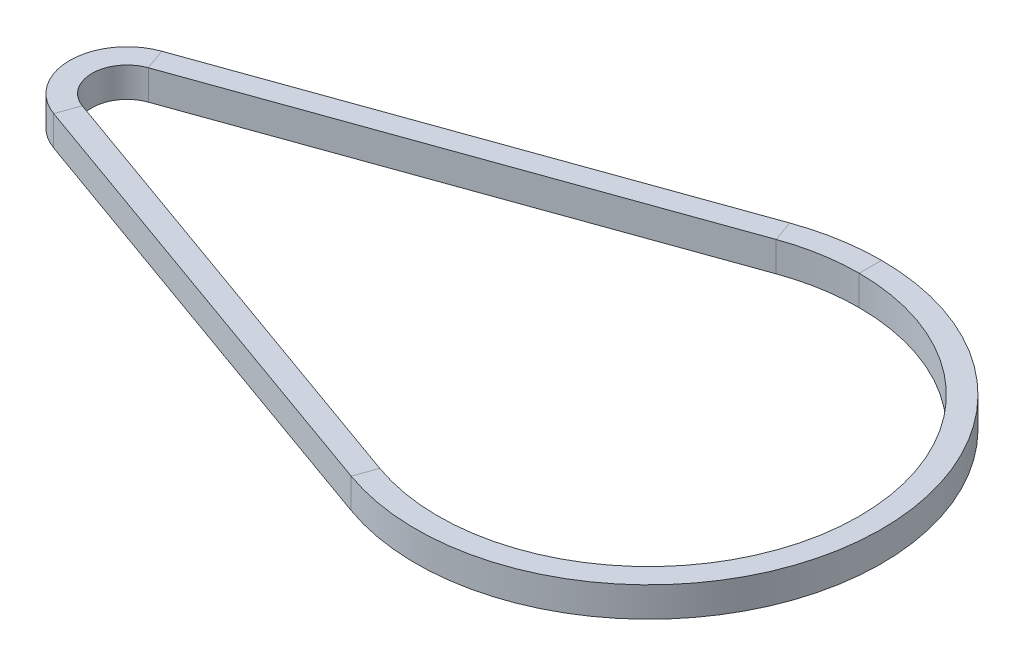
ISO-10303-21;
HEADER;
FILE_DESCRIPTION(('STEP AP214'),'2;1');
FILE_NAME('part.step','',(''),(''),'','','');
FILE_SCHEMA(('AUTOMOTIVE_DESIGN { 1 0 10303 214 1 1 1 1 }'));
ENDSEC;
DATA;
#1=APPLICATION_CONTEXT('core data for automotive mechanical design processes');
#2=APPLICATION_PROTOCOL_DEFINITION('international standard','automotive_design',2000,#1);
#3=PRODUCT_CONTEXT('',#1,'mechanical');
#4=PRODUCT('Part','Part','',(#3));
#5=PRODUCT_RELATED_PRODUCT_CATEGORY('part','',(#4));
#6=PRODUCT_DEFINITION_FORMATION('','',#4);
#7=PRODUCT_DEFINITION_CONTEXT('part definition',#1,'design');
#8=PRODUCT_DEFINITION('design','',#6,#7);
#9=PRODUCT_DEFINITION_SHAPE('','',#8);
#10=(LENGTH_UNIT() NAMED_UNIT(*) SI_UNIT(.MILLI.,.METRE.));
#11=(NAMED_UNIT(*) PLANE_ANGLE_UNIT() SI_UNIT($,.RADIAN.));
#12=(NAMED_UNIT(*) SI_UNIT($,.STERADIAN.) SOLID_ANGLE_UNIT());
#13=UNCERTAINTY_MEASURE_WITH_UNIT(LENGTH_MEASURE(1.E-05),#10,'distance_accuracy_value','');
#14=(GEOMETRIC_REPRESENTATION_CONTEXT(3) GLOBAL_UNCERTAINTY_ASSIGNED_CONTEXT((#13)) GLOBAL_UNIT_ASSIGNED_CONTEXT((#10,
#11,#12)) REPRESENTATION_CONTEXT('',''));
#15=CARTESIAN_POINT('',(0.,0.,0.));
#16=DIRECTION('',(0.,0.,1.));
#17=DIRECTION('',(1.,0.,0.));
#18=AXIS2_PLACEMENT_3D('',#15,#16,#17);
#19=CARTESIAN_POINT('',(59.4944342857143,-2.,-29.4205827444465));
#20=DIRECTION('',(0.,-1.,0.));
#21=DIRECTION('',(0.,0.,-1.));
#22=AXIS2_PLACEMENT_3D('',#19,#20,#21);
#23=PLANE('',#22);
#24=CARTESIAN_POINT('',(70.,-2.,0.));
#25=DIRECTION('',(0.,-1.,0.));
#26=DIRECTION('',(-0.336285714285714,0.,-0.941760011025817));
#27=AXIS2_PLACEMENT_3D('',#24,#25,#26);
#28=CIRCLE('',#27,28.24);
#29=CARTESIAN_POINT('',(60.5032914285715,-2.,-26.5953027113691));
#30=VERTEX_POINT('',#29);
#31=CARTESIAN_POINT('',(70.,-2.,-28.24));
#32=VERTEX_POINT('',#31);
#33=EDGE_CURVE('E11',#30,#32,#28,.T.);
#34=ORIENTED_EDGE('',*,*,#33,.F.);
#35=DIRECTION('',(-0.336285714285714,0.,-0.941760011025817));
#36=VECTOR('',#35,1.);
#37=CARTESIAN_POINT('',(59.4944342857143,-2.,-29.4205827444465));
#38=LINE('',#37,#36);
#39=CARTESIAN_POINT('',(59.4944342857143,-2.,-29.4205827444465));
#40=VERTEX_POINT('',#39);
#41=EDGE_CURVE('E36',#30,#40,#38,.T.);
#42=ORIENTED_EDGE('',*,*,#41,.T.);
#43=CARTESIAN_POINT('',(70.,-2.,0.));
#44=DIRECTION('',(0.,-1.,0.));
#45=DIRECTION('',(-0.336285714285714,0.,-0.941760011025817));
#46=AXIS2_PLACEMENT_3D('',#43,#44,#45);
#47=CIRCLE('',#46,31.24);
#48=CARTESIAN_POINT('',(70.,-2.,-31.24));
#49=VERTEX_POINT('',#48);
#50=EDGE_CURVE('E133',#40,#49,#47,.T.);
#51=ORIENTED_EDGE('',*,*,#50,.T.);
#52=DIRECTION('',(0.,0.,-1.));
#53=VECTOR('',#52,1.);
#54=CARTESIAN_POINT('',(70.,-2.,-31.24));
#55=LINE('',#54,#53);
#56=EDGE_CURVE('E136',#32,#49,#55,.T.);
#57=ORIENTED_EDGE('',*,*,#56,.F.);
#58=EDGE_LOOP('',(#34,#42,#51,#57));
#59=FACE_BOUND('',#58,.T.);
#60=ADVANCED_FACE('F33',(#59),#23,.T.);
#61=CARTESIAN_POINT('',(70.,0.,0.));
#62=DIRECTION('',(0.,-1.,0.));
#63=DIRECTION('',(0.,0.,-1.));
#64=AXIS2_PLACEMENT_3D('',#61,#62,#63);
#65=CYLINDRICAL_SURFACE('',#64,28.24);
#66=CARTESIAN_POINT('',(70.,2.,0.));
#67=DIRECTION('',(0.,-1.,0.));
#68=DIRECTION('',(-0.336285714285714,0.,-0.941760011025817));
#69=AXIS2_PLACEMENT_3D('',#66,#67,#68);
#70=CIRCLE('',#69,28.24);
#71=CARTESIAN_POINT('',(60.5032914285715,2.,-26.5953027113691));
#72=VERTEX_POINT('',#71);
#73=CARTESIAN_POINT('',(70.,2.,-28.24));
#74=VERTEX_POINT('',#73);
#75=EDGE_CURVE('E41',#72,#74,#70,.T.);
#76=ORIENTED_EDGE('',*,*,#75,.F.);
#77=DIRECTION('',(0.,-1.,0.));
#78=VECTOR('',#77,1.);
#79=CARTESIAN_POINT('',(60.5032914285715,-2.,-26.5953027113691));
#80=LINE('',#79,#78);
#81=EDGE_CURVE('E219',#72,#30,#80,.T.);
#82=ORIENTED_EDGE('',*,*,#81,.T.);
#83=ORIENTED_EDGE('',*,*,#33,.T.);
#84=DIRECTION('',(0.,-1.,0.));
#85=VECTOR('',#84,1.);
#86=CARTESIAN_POINT('',(70.,-2.,-28.24));
#87=LINE('',#86,#85);
#88=EDGE_CURVE('E160',#74,#32,#87,.T.);
#89=ORIENTED_EDGE('',*,*,#88,.F.);
#90=EDGE_LOOP('',(#76,#82,#83,#89));
#91=FACE_BOUND('',#90,.T.);
#92=ADVANCED_FACE('F265',(#91),#65,.F.);
#93=CARTESIAN_POINT('',(59.4944342857143,2.,-29.4205827444465));
#94=DIRECTION('',(0.,1.,0.));
#95=DIRECTION('',(0.,0.,1.));
#96=AXIS2_PLACEMENT_3D('',#93,#94,#95);
#97=PLANE('',#96);
#98=CARTESIAN_POINT('',(70.,2.,0.));
#99=DIRECTION('',(0.,-1.,0.));
#100=DIRECTION('',(-0.336285714285714,0.,-0.941760011025817));
#101=AXIS2_PLACEMENT_3D('',#98,#99,#100);
#102=CIRCLE('',#101,31.24);
#103=CARTESIAN_POINT('',(59.4944342857143,2.,-29.4205827444465));
#104=VERTEX_POINT('',#103);
#105=CARTESIAN_POINT('',(70.,2.,-31.24));
#106=VERTEX_POINT('',#105);
#107=EDGE_CURVE('E142',#104,#106,#102,.T.);
#108=ORIENTED_EDGE('',*,*,#107,.F.);
#109=DIRECTION('',(0.336285714285714,0.,0.941760011025817));
#110=VECTOR('',#109,1.);
#111=CARTESIAN_POINT('',(59.4944342857143,2.,-29.4205827444465));
#112=LINE('',#111,#110);
#113=EDGE_CURVE('E197',#104,#72,#112,.T.);
#114=ORIENTED_EDGE('',*,*,#113,.T.);
#115=ORIENTED_EDGE('',*,*,#75,.T.);
#116=DIRECTION('',(0.,0.,1.));
#117=VECTOR('',#116,1.);
#118=CARTESIAN_POINT('',(70.,2.,-31.24));
#119=LINE('',#118,#117);
#120=EDGE_CURVE('E164',#106,#74,#119,.T.);
#121=ORIENTED_EDGE('',*,*,#120,.F.);
#122=EDGE_LOOP('',(#108,#114,#115,#121));
#123=FACE_BOUND('',#122,.T.);
#124=ADVANCED_FACE('F269',(#123),#97,.T.);
#125=CARTESIAN_POINT('',(-2.5894,-2.,-7.25155208489878));
#126=DIRECTION('',(0.,-1.,0.));
#127=DIRECTION('',(0.,0.,-1.));
#128=AXIS2_PLACEMENT_3D('',#125,#126,#127);
#129=PLANE('',#128);
#130=ORIENTED_EDGE('',*,*,#41,.F.);
#131=DIRECTION('',(0.941760011025817,0.,-0.336285714285714));
#132=VECTOR('',#131,1.);
#133=CARTESIAN_POINT('',(-1.58054285714286,-2.,-4.42627205182133));
#134=LINE('',#133,#132);
#135=CARTESIAN_POINT('',(-1.58054285714285,-2.,-4.42627205182134));
#136=VERTEX_POINT('',#135);
#137=EDGE_CURVE('E82',#136,#30,#134,.T.);
#138=ORIENTED_EDGE('',*,*,#137,.F.);
#139=DIRECTION('',(-0.336285714285714,0.,-0.941760011025817));
#140=VECTOR('',#139,1.);
#141=CARTESIAN_POINT('',(-2.58939999999999,-2.,-7.25155208489878));
#142=LINE('',#141,#140);
#143=CARTESIAN_POINT('',(-2.58939999999999,-2.,-7.25155208489879));
#144=VERTEX_POINT('',#143);
#145=EDGE_CURVE('E200',#136,#144,#142,.T.);
#146=ORIENTED_EDGE('',*,*,#145,.T.);
#147=DIRECTION('',(0.941760011025817,0.,-0.336285714285714));
#148=VECTOR('',#147,1.);
#149=CARTESIAN_POINT('',(-2.5894,-2.,-7.25155208489878));
#150=LINE('',#149,#148);
#151=EDGE_CURVE('E195',#144,#40,#150,.T.);
#152=ORIENTED_EDGE('',*,*,#151,.T.);
#153=EDGE_LOOP('',(#130,#138,#146,#152));
#154=FACE_BOUND('',#153,.T.);
#155=ADVANCED_FACE('F238',(#154),#129,.T.);
#156=CARTESIAN_POINT('',(-1.58054285714286,-2.,-4.42627205182133));
#157=DIRECTION('',(0.336285714285714,0.,0.941760011025817));
#158=DIRECTION('',(0.941760011025817,0.,-0.336285714285714));
#159=AXIS2_PLACEMENT_3D('',#156,#157,#158);
#160=PLANE('',#159);
#161=ORIENTED_EDGE('',*,*,#137,.T.);
#162=ORIENTED_EDGE('',*,*,#81,.F.);
#163=DIRECTION('',(0.941760011025817,0.,-0.336285714285714));
#164=VECTOR('',#163,1.);
#165=CARTESIAN_POINT('',(-1.58054285714286,2.,-4.42627205182133));
#166=LINE('',#165,#164);
#167=CARTESIAN_POINT('',(-1.58054285714285,2.,-4.42627205182134));
#168=VERTEX_POINT('',#167);
#169=EDGE_CURVE('E91',#168,#72,#166,.T.);
#170=ORIENTED_EDGE('',*,*,#169,.F.);
#171=DIRECTION('',(0.,-1.,0.));
#172=VECTOR('',#171,1.);
#173=CARTESIAN_POINT('',(-1.58054285714285,-2.,-4.42627205182133));
#174=LINE('',#173,#172);
#175=EDGE_CURVE('E215',#168,#136,#174,.T.);
#176=ORIENTED_EDGE('',*,*,#175,.T.);
#177=EDGE_LOOP('',(#161,#162,#170,#176));
#178=FACE_BOUND('',#177,.T.);
#179=ADVANCED_FACE('F266',(#178),#160,.T.);
#180=CARTESIAN_POINT('',(-2.5894,2.,-7.25155208489878));
#181=DIRECTION('',(0.,1.,0.));
#182=DIRECTION('',(0.,0.,1.));
#183=AXIS2_PLACEMENT_3D('',#180,#181,#182);
#184=PLANE('',#183);
#185=ORIENTED_EDGE('',*,*,#169,.T.);
#186=ORIENTED_EDGE('',*,*,#113,.F.);
#187=DIRECTION('',(0.941760011025817,0.,-0.336285714285714));
#188=VECTOR('',#187,1.);
#189=CARTESIAN_POINT('',(-2.5894,2.,-7.25155208489878));
#190=LINE('',#189,#188);
#191=CARTESIAN_POINT('',(-2.58939999999999,2.,-7.25155208489879));
#192=VERTEX_POINT('',#191);
#193=EDGE_CURVE('E99',#192,#104,#190,.T.);
#194=ORIENTED_EDGE('',*,*,#193,.F.);
#195=DIRECTION('',(0.336285714285714,0.,0.941760011025817));
#196=VECTOR('',#195,1.);
#197=CARTESIAN_POINT('',(-2.58939999999999,2.,-7.25155208489878));
#198=LINE('',#197,#196);
#199=EDGE_CURVE('E189',#192,#168,#198,.T.);
#200=ORIENTED_EDGE('',*,*,#199,.T.);
#201=EDGE_LOOP('',(#185,#186,#194,#200));
#202=FACE_BOUND('',#201,.T.);
#203=ADVANCED_FACE('F267',(#202),#184,.T.);
#204=CARTESIAN_POINT('',(-2.5894,-2.,-7.25155208489878));
#205=DIRECTION('',(-0.336285714285714,0.,-0.941760011025817));
#206=DIRECTION('',(-0.941760011025817,0.,0.336285714285714));
#207=AXIS2_PLACEMENT_3D('',#204,#205,#206);
#208=PLANE('',#207);
#209=ORIENTED_EDGE('',*,*,#193,.T.);
#210=DIRECTION('',(0.,1.,0.));
#211=VECTOR('',#210,1.);
#212=CARTESIAN_POINT('',(59.4944342857143,-2.,-29.4205827444465));
#213=LINE('',#212,#211);
#214=EDGE_CURVE('E193',#40,#104,#213,.T.);
#215=ORIENTED_EDGE('',*,*,#214,.F.);
#216=ORIENTED_EDGE('',*,*,#151,.F.);
#217=DIRECTION('',(0.,1.,0.));
#218=VECTOR('',#217,1.);
#219=CARTESIAN_POINT('',(-2.58939999999999,-2.,-7.25155208489878));
#220=LINE('',#219,#218);
#221=EDGE_CURVE('E182',#144,#192,#220,.T.);
#222=ORIENTED_EDGE('',*,*,#221,.T.);
#223=EDGE_LOOP('',(#209,#215,#216,#222));
#224=FACE_BOUND('',#223,.T.);
#225=ADVANCED_FACE('F313',(#224),#208,.T.);
#226=CARTESIAN_POINT('',(-2.58940000000001,-2.,7.25155208489878));
#227=DIRECTION('',(0.,-1.,0.));
#228=DIRECTION('',(0.,0.,-1.));
#229=AXIS2_PLACEMENT_3D('',#226,#227,#228);
#230=PLANE('',#229);
#231=ORIENTED_EDGE('',*,*,#145,.F.);
#232=CARTESIAN_POINT('',(0.,-2.,0.));
#233=DIRECTION('',(0.,-1.,0.));
#234=DIRECTION('',(-0.336285714285716,0.,0.941760011025817));
#235=AXIS2_PLACEMENT_3D('',#232,#233,#234);
#236=CIRCLE('',#235,4.69999999999999);
#237=CARTESIAN_POINT('',(-1.58054285714285,-2.,4.42627205182133));
#238=VERTEX_POINT('',#237);
#239=EDGE_CURVE('E229',#238,#136,#236,.T.);
#240=ORIENTED_EDGE('',*,*,#239,.F.);
#241=DIRECTION('',(-0.336285714285714,0.,0.941760011025817));
#242=VECTOR('',#241,1.);
#243=CARTESIAN_POINT('',(-2.58940000000001,-2.,7.25155208489878));
#244=LINE('',#243,#242);
#245=CARTESIAN_POINT('',(-2.58939999999999,-2.,7.25155208489878));
#246=VERTEX_POINT('',#245);
#247=EDGE_CURVE('E192',#238,#246,#244,.T.);
#248=ORIENTED_EDGE('',*,*,#247,.T.);
#249=CARTESIAN_POINT('',(0.,-2.,0.));
#250=DIRECTION('',(0.,-1.,0.));
#251=DIRECTION('',(-0.336285714285715,0.,0.941760011025817));
#252=AXIS2_PLACEMENT_3D('',#249,#250,#251);
#253=CIRCLE('',#252,7.69999999999999);
#254=EDGE_CURVE('E186',#246,#144,#253,.T.);
#255=ORIENTED_EDGE('',*,*,#254,.T.);
#256=EDGE_LOOP('',(#231,#240,#248,#255));
#257=FACE_BOUND('',#256,.T.);
#258=ADVANCED_FACE('F245',(#257),#230,.T.);
#259=CARTESIAN_POINT('',(0.,0.,0.));
#260=DIRECTION('',(0.,-1.,0.));
#261=DIRECTION('',(0.,0.,-1.));
#262=AXIS2_PLACEMENT_3D('',#259,#260,#261);
#263=CYLINDRICAL_SURFACE('',#262,4.69999999999999);
#264=ORIENTED_EDGE('',*,*,#239,.T.);
#265=ORIENTED_EDGE('',*,*,#175,.F.);
#266=CARTESIAN_POINT('',(0.,2.,0.));
#267=DIRECTION('',(0.,-1.,0.));
#268=DIRECTION('',(-0.336285714285716,0.,0.941760011025817));
#269=AXIS2_PLACEMENT_3D('',#266,#267,#268);
#270=CIRCLE('',#269,4.69999999999999);
#271=CARTESIAN_POINT('',(-1.58054285714285,2.,4.42627205182133));
#272=VERTEX_POINT('',#271);
#273=EDGE_CURVE('E212',#272,#168,#270,.T.);
#274=ORIENTED_EDGE('',*,*,#273,.F.);
#275=DIRECTION('',(0.,-1.,0.));
#276=VECTOR('',#275,1.);
#277=CARTESIAN_POINT('',(-1.58054285714286,-2.,4.42627205182133));
#278=LINE('',#277,#276);
#279=EDGE_CURVE('E209',#272,#238,#278,.T.);
#280=ORIENTED_EDGE('',*,*,#279,.T.);
#281=EDGE_LOOP('',(#264,#265,#274,#280));
#282=FACE_BOUND('',#281,.T.);
#283=ADVANCED_FACE('F329',(#282),#263,.F.);
#284=CARTESIAN_POINT('',(-2.58940000000001,2.,7.25155208489878));
#285=DIRECTION('',(0.,1.,0.));
#286=DIRECTION('',(0.,0.,1.));
#287=AXIS2_PLACEMENT_3D('',#284,#285,#286);
#288=PLANE('',#287);
#289=ORIENTED_EDGE('',*,*,#273,.T.);
#290=ORIENTED_EDGE('',*,*,#199,.F.);
#291=CARTESIAN_POINT('',(0.,2.,0.));
#292=DIRECTION('',(0.,-1.,0.));
#293=DIRECTION('',(-0.336285714285715,0.,0.941760011025817));
#294=AXIS2_PLACEMENT_3D('',#291,#292,#293);
#295=CIRCLE('',#294,7.69999999999999);
#296=CARTESIAN_POINT('',(-2.58939999999999,2.,7.25155208489878));
#297=VERTEX_POINT('',#296);
#298=EDGE_CURVE('E185',#297,#192,#295,.T.);
#299=ORIENTED_EDGE('',*,*,#298,.F.);
#300=DIRECTION('',(0.336285714285714,0.,-0.941760011025817));
#301=VECTOR('',#300,1.);
#302=CARTESIAN_POINT('',(-2.58940000000001,2.,7.25155208489878));
#303=LINE('',#302,#301);
#304=EDGE_CURVE('E176',#297,#272,#303,.T.);
#305=ORIENTED_EDGE('',*,*,#304,.T.);
#306=EDGE_LOOP('',(#289,#290,#299,#305));
#307=FACE_BOUND('',#306,.T.);
#308=ADVANCED_FACE('F259',(#307),#288,.T.);
#309=CARTESIAN_POINT('',(0.,0.,0.));
#310=DIRECTION('',(0.,-1.,0.));
#311=DIRECTION('',(0.,0.,-1.));
#312=AXIS2_PLACEMENT_3D('',#309,#310,#311);
#313=CYLINDRICAL_SURFACE('',#312,7.69999999999999);
#314=ORIENTED_EDGE('',*,*,#298,.T.);
#315=ORIENTED_EDGE('',*,*,#221,.F.);
#316=ORIENTED_EDGE('',*,*,#254,.F.);
#317=DIRECTION('',(0.,1.,0.));
#318=VECTOR('',#317,1.);
#319=CARTESIAN_POINT('',(-2.58940000000001,-2.,7.25155208489878));
#320=LINE('',#319,#318);
#321=EDGE_CURVE('E173',#246,#297,#320,.T.);
#322=ORIENTED_EDGE('',*,*,#321,.T.);
#323=EDGE_LOOP('',(#314,#315,#316,#322));
#324=FACE_BOUND('',#323,.T.);
#325=ADVANCED_FACE('F243',(#324),#313,.T.);
#326=CARTESIAN_POINT('',(59.4944342857143,-2.,29.4205827444465));
#327=DIRECTION('',(0.,-1.,0.));
#328=DIRECTION('',(0.,0.,-1.));
#329=AXIS2_PLACEMENT_3D('',#326,#327,#328);
#330=PLANE('',#329);
#331=ORIENTED_EDGE('',*,*,#247,.F.);
#332=DIRECTION('',(-0.941760011025817,0.,-0.336285714285714));
#333=VECTOR('',#332,1.);
#334=CARTESIAN_POINT('',(60.5032914285714,-2.,26.5953027113691));
#335=LINE('',#334,#333);
#336=CARTESIAN_POINT('',(60.5032914285714,-2.,26.5953027113691));
#337=VERTEX_POINT('',#336);
#338=EDGE_CURVE('E177',#337,#238,#335,.T.);
#339=ORIENTED_EDGE('',*,*,#338,.F.);
#340=DIRECTION('',(-0.336285714285715,0.,0.941760011025817));
#341=VECTOR('',#340,1.);
#342=CARTESIAN_POINT('',(59.4944342857143,-2.,29.4205827444465));
#343=LINE('',#342,#341);
#344=CARTESIAN_POINT('',(59.4944342857143,-2.,29.4205827444465));
#345=VERTEX_POINT('',#344);
#346=EDGE_CURVE('E181',#337,#345,#343,.T.);
#347=ORIENTED_EDGE('',*,*,#346,.T.);
#348=DIRECTION('',(-0.941760011025817,0.,-0.336285714285714));
#349=VECTOR('',#348,1.);
#350=CARTESIAN_POINT('',(59.4944342857143,-2.,29.4205827444465));
#351=LINE('',#350,#349);
#352=EDGE_CURVE('E179',#345,#246,#351,.T.);
#353=ORIENTED_EDGE('',*,*,#352,.T.);
#354=EDGE_LOOP('',(#331,#339,#347,#353));
#355=FACE_BOUND('',#354,.T.);
#356=ADVANCED_FACE('F249',(#355),#330,.T.);
#357=CARTESIAN_POINT('',(60.5032914285714,-2.,26.5953027113691));
#358=DIRECTION('',(0.336285714285714,0.,-0.941760011025817));
#359=DIRECTION('',(-0.941760011025817,0.,-0.336285714285714));
#360=AXIS2_PLACEMENT_3D('',#357,#358,#359);
#361=PLANE('',#360);
#362=ORIENTED_EDGE('',*,*,#338,.T.);
#363=ORIENTED_EDGE('',*,*,#279,.F.);
#364=DIRECTION('',(-0.941760011025817,0.,-0.336285714285714));
#365=VECTOR('',#364,1.);
#366=CARTESIAN_POINT('',(60.5032914285714,2.,26.5953027113691));
#367=LINE('',#366,#365);
#368=CARTESIAN_POINT('',(60.5032914285714,2.,26.5953027113691));
#369=VERTEX_POINT('',#368);
#370=EDGE_CURVE('E114',#369,#272,#367,.T.);
#371=ORIENTED_EDGE('',*,*,#370,.F.);
#372=DIRECTION('',(0.,-1.,0.));
#373=VECTOR('',#372,1.);
#374=CARTESIAN_POINT('',(60.5032914285714,-2.,26.5953027113691));
#375=LINE('',#374,#373);
#376=EDGE_CURVE('E206',#369,#337,#375,.T.);
#377=ORIENTED_EDGE('',*,*,#376,.T.);
#378=EDGE_LOOP('',(#362,#363,#371,#377));
#379=FACE_BOUND('',#378,.T.);
#380=ADVANCED_FACE('F255',(#379),#361,.T.);
#381=CARTESIAN_POINT('',(59.4944342857143,2.,29.4205827444465));
#382=DIRECTION('',(0.,1.,0.));
#383=DIRECTION('',(0.,0.,1.));
#384=AXIS2_PLACEMENT_3D('',#381,#382,#383);
#385=PLANE('',#384);
#386=ORIENTED_EDGE('',*,*,#370,.T.);
#387=ORIENTED_EDGE('',*,*,#304,.F.);
#388=DIRECTION('',(-0.941760011025817,0.,-0.336285714285714));
#389=VECTOR('',#388,1.);
#390=CARTESIAN_POINT('',(59.4944342857143,2.,29.4205827444465));
#391=LINE('',#390,#389);
#392=CARTESIAN_POINT('',(59.4944342857143,2.,29.4205827444465));
#393=VERTEX_POINT('',#392);
#394=EDGE_CURVE('E121',#393,#297,#391,.T.);
#395=ORIENTED_EDGE('',*,*,#394,.F.);
#396=DIRECTION('',(0.336285714285715,0.,-0.941760011025817));
#397=VECTOR('',#396,1.);
#398=CARTESIAN_POINT('',(59.4944342857143,2.,29.4205827444465));
#399=LINE('',#398,#397);
#400=EDGE_CURVE('E171',#393,#369,#399,.T.);
#401=ORIENTED_EDGE('',*,*,#400,.T.);
#402=EDGE_LOOP('',(#386,#387,#395,#401));
#403=FACE_BOUND('',#402,.T.);
#404=ADVANCED_FACE('F260',(#403),#385,.T.);
#405=CARTESIAN_POINT('',(59.4944342857143,-2.,29.4205827444465));
#406=DIRECTION('',(-0.336285714285714,0.,0.941760011025817));
#407=DIRECTION('',(0.941760011025817,0.,0.336285714285714));
#408=AXIS2_PLACEMENT_3D('',#405,#406,#407);
#409=PLANE('',#408);
#410=ORIENTED_EDGE('',*,*,#394,.T.);
#411=ORIENTED_EDGE('',*,*,#321,.F.);
#412=ORIENTED_EDGE('',*,*,#352,.F.);
#413=DIRECTION('',(0.,1.,0.));
#414=VECTOR('',#413,1.);
#415=CARTESIAN_POINT('',(59.4944342857143,-2.,29.4205827444465));
#416=LINE('',#415,#414);
#417=EDGE_CURVE('E152',#345,#393,#416,.T.);
#418=ORIENTED_EDGE('',*,*,#417,.T.);
#419=EDGE_LOOP('',(#410,#411,#412,#418));
#420=FACE_BOUND('',#419,.T.);
#421=ADVANCED_FACE('F248',(#420),#409,.T.);
#422=CARTESIAN_POINT('',(70.,-2.,-31.24));
#423=DIRECTION('',(0.,-1.,0.));
#424=DIRECTION('',(0.,0.,-1.));
#425=AXIS2_PLACEMENT_3D('',#422,#423,#424);
#426=PLANE('',#425);
#427=ORIENTED_EDGE('',*,*,#346,.F.);
#428=CARTESIAN_POINT('',(70.,-2.,0.));
#429=DIRECTION('',(0.,-1.,0.));
#430=DIRECTION('',(0.,0.,-1.));
#431=AXIS2_PLACEMENT_3D('',#428,#429,#430);
#432=CIRCLE('',#431,28.24);
#433=EDGE_CURVE('E159',#32,#337,#432,.T.);
#434=ORIENTED_EDGE('',*,*,#433,.F.);
#435=ORIENTED_EDGE('',*,*,#56,.T.);
#436=CARTESIAN_POINT('',(70.,-2.,0.));
#437=DIRECTION('',(0.,-1.,0.));
#438=DIRECTION('',(0.,0.,-1.));
#439=AXIS2_PLACEMENT_3D('',#436,#437,#438);
#440=CIRCLE('',#439,31.24);
#441=EDGE_CURVE('E148',#49,#345,#440,.T.);
#442=ORIENTED_EDGE('',*,*,#441,.T.);
#443=EDGE_LOOP('',(#427,#434,#435,#442));
#444=FACE_BOUND('',#443,.T.);
#445=ADVANCED_FACE('F157',(#444),#426,.T.);
#446=CARTESIAN_POINT('',(70.,0.,0.));
#447=DIRECTION('',(0.,-1.,0.));
#448=DIRECTION('',(0.,0.,-1.));
#449=AXIS2_PLACEMENT_3D('',#446,#447,#448);
#450=CYLINDRICAL_SURFACE('',#449,28.24);
#451=ORIENTED_EDGE('',*,*,#433,.T.);
#452=ORIENTED_EDGE('',*,*,#376,.F.);
#453=CARTESIAN_POINT('',(70.,2.,0.));
#454=DIRECTION('',(0.,-1.,0.));
#455=DIRECTION('',(0.,0.,-1.));
#456=AXIS2_PLACEMENT_3D('',#453,#454,#455);
#457=CIRCLE('',#456,28.24);
#458=EDGE_CURVE('E203',#74,#369,#457,.T.);
#459=ORIENTED_EDGE('',*,*,#458,.F.);
#460=ORIENTED_EDGE('',*,*,#88,.T.);
#461=EDGE_LOOP('',(#451,#452,#459,#460));
#462=FACE_BOUND('',#461,.T.);
#463=ADVANCED_FACE('F252',(#462),#450,.F.);
#464=CARTESIAN_POINT('',(70.,2.,-31.24));
#465=DIRECTION('',(0.,1.,0.));
#466=DIRECTION('',(0.,0.,1.));
#467=AXIS2_PLACEMENT_3D('',#464,#465,#466);
#468=PLANE('',#467);
#469=ORIENTED_EDGE('',*,*,#458,.T.);
#470=ORIENTED_EDGE('',*,*,#400,.F.);
#471=CARTESIAN_POINT('',(70.,2.,0.));
#472=DIRECTION('',(0.,-1.,0.));
#473=DIRECTION('',(0.,0.,-1.));
#474=AXIS2_PLACEMENT_3D('',#471,#472,#473);
#475=CIRCLE('',#474,31.24);
#476=EDGE_CURVE('E170',#106,#393,#475,.T.);
#477=ORIENTED_EDGE('',*,*,#476,.F.);
#478=ORIENTED_EDGE('',*,*,#120,.T.);
#479=EDGE_LOOP('',(#469,#470,#477,#478));
#480=FACE_BOUND('',#479,.T.);
#481=ADVANCED_FACE('F263',(#480),#468,.T.);
#482=CARTESIAN_POINT('',(70.,0.,0.));
#483=DIRECTION('',(0.,-1.,0.));
#484=DIRECTION('',(0.,0.,-1.));
#485=AXIS2_PLACEMENT_3D('',#482,#483,#484);
#486=CYLINDRICAL_SURFACE('',#485,31.24);
#487=ORIENTED_EDGE('',*,*,#476,.T.);
#488=ORIENTED_EDGE('',*,*,#417,.F.);
#489=ORIENTED_EDGE('',*,*,#441,.F.);
#490=DIRECTION('',(0.,1.,0.));
#491=VECTOR('',#490,1.);
#492=CARTESIAN_POINT('',(70.,-2.,-31.24));
#493=LINE('',#492,#491);
#494=EDGE_CURVE('E151',#49,#106,#493,.T.);
#495=ORIENTED_EDGE('',*,*,#494,.T.);
#496=EDGE_LOOP('',(#487,#488,#489,#495));
#497=FACE_BOUND('',#496,.T.);
#498=ADVANCED_FACE('F150',(#497),#486,.T.);
#499=CARTESIAN_POINT('',(70.,0.,0.));
#500=DIRECTION('',(0.,-1.,0.));
#501=DIRECTION('',(0.,0.,-1.));
#502=AXIS2_PLACEMENT_3D('',#499,#500,#501);
#503=CYLINDRICAL_SURFACE('',#502,31.24);
#504=ORIENTED_EDGE('',*,*,#214,.T.);
#505=ORIENTED_EDGE('',*,*,#107,.T.);
#506=ORIENTED_EDGE('',*,*,#494,.F.);
#507=ORIENTED_EDGE('',*,*,#50,.F.);
#508=EDGE_LOOP('',(#504,#505,#506,#507));
#509=FACE_BOUND('',#508,.T.);
#510=ADVANCED_FACE('F162',(#509),#503,.T.);
#511=CLOSED_SHELL('',(#60,#92,#124,#155,#179,#203,#225,#258,#283,#308,#325,#356,#380,#404,#421,
#445,#463,#481,#498,#510));
#512=MANIFOLD_SOLID_BREP('B2',#511);
#513=ADVANCED_BREP_SHAPE_REPRESENTATION('',(#18,#512),#14);
#514=SHAPE_DEFINITION_REPRESENTATION(#9,#513);
ENDSEC;
END-ISO-10303-21;
